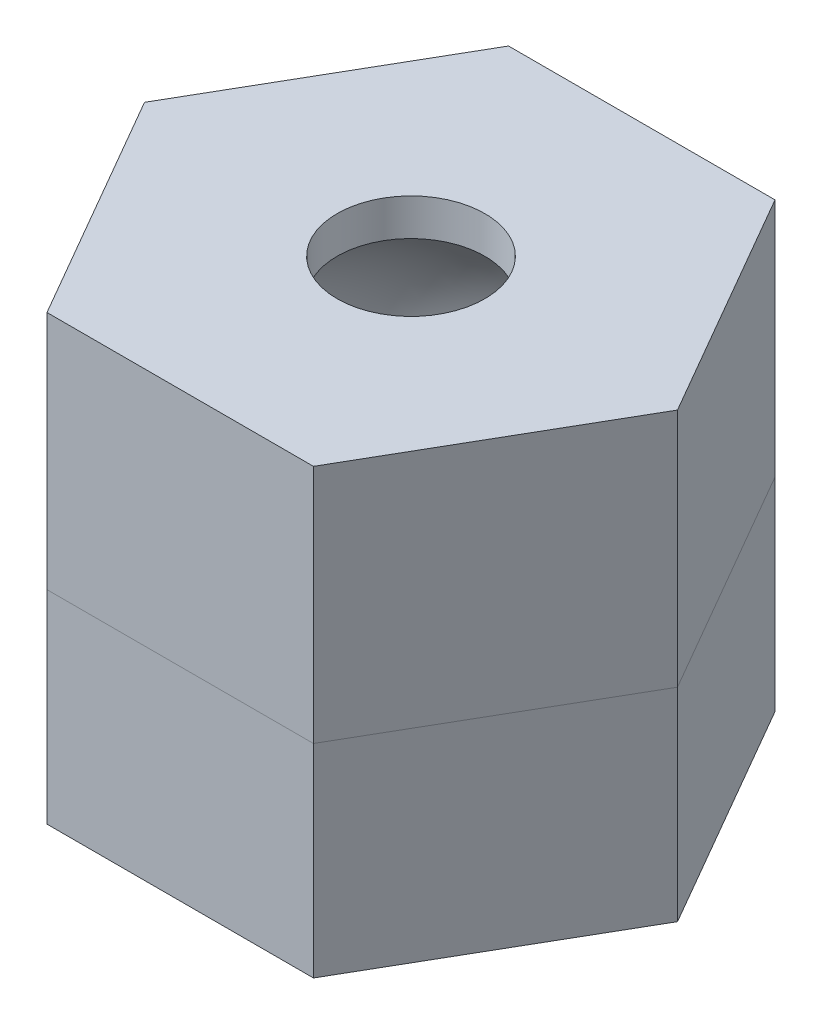
ISO-10303-21;
HEADER;
FILE_DESCRIPTION(('STEP AP214'),'2;1');
FILE_NAME('part.step','',(''),(''),'','','');
FILE_SCHEMA(('AUTOMOTIVE_DESIGN { 1 0 10303 214 1 1 1 1 }'));
ENDSEC;
DATA;
#1=APPLICATION_CONTEXT('core data for automotive mechanical design processes');
#2=APPLICATION_PROTOCOL_DEFINITION('international standard','automotive_design',2000,#1);
#3=PRODUCT_CONTEXT('',#1,'mechanical');
#4=PRODUCT('Part','Part','',(#3));
#5=PRODUCT_RELATED_PRODUCT_CATEGORY('part','',(#4));
#6=PRODUCT_DEFINITION_FORMATION('','',#4);
#7=PRODUCT_DEFINITION_CONTEXT('part definition',#1,'design');
#8=PRODUCT_DEFINITION('design','',#6,#7);
#9=PRODUCT_DEFINITION_SHAPE('','',#8);
#10=(LENGTH_UNIT() NAMED_UNIT(*) SI_UNIT(.MILLI.,.METRE.));
#11=(NAMED_UNIT(*) PLANE_ANGLE_UNIT() SI_UNIT($,.RADIAN.));
#12=(NAMED_UNIT(*) SI_UNIT($,.STERADIAN.) SOLID_ANGLE_UNIT());
#13=UNCERTAINTY_MEASURE_WITH_UNIT(LENGTH_MEASURE(1.E-05),#10,'distance_accuracy_value','');
#14=(GEOMETRIC_REPRESENTATION_CONTEXT(3) GLOBAL_UNCERTAINTY_ASSIGNED_CONTEXT((#13)) GLOBAL_UNIT_ASSIGNED_CONTEXT((#10,
#11,#12)) REPRESENTATION_CONTEXT('',''));
#15=CARTESIAN_POINT('',(0.,0.,0.));
#16=DIRECTION('',(0.,0.,1.));
#17=DIRECTION('',(1.,0.,0.));
#18=AXIS2_PLACEMENT_3D('',#15,#16,#17);
#19=CARTESIAN_POINT('',(0.,55.,0.));
#20=DIRECTION('',(0.,1.,0.));
#21=DIRECTION('',(0.,0.,1.));
#22=AXIS2_PLACEMENT_3D('',#19,#20,#21);
#23=PLANE('',#22);
#24=CARTESIAN_POINT('',(31.25,55.,-54.1265877365274));
#25=DIRECTION('',(0.,1.,0.));
#26=DIRECTION('',(0.,0.,1.));
#27=AXIS2_PLACEMENT_3D('',#24,#25,#26);
#28=CIRCLE('',#27,4.50000000000001);
#29=CARTESIAN_POINT('',(31.25,55.,-49.6265877365274));
#30=VERTEX_POINT('',#29);
#31=EDGE_CURVE('E249',#30,#30,#28,.T.);
#32=ORIENTED_EDGE('',*,*,#31,.F.);
#33=EDGE_LOOP('',(#32));
#34=FACE_BOUND('',#33,.T.);
#35=CARTESIAN_POINT('',(-31.25,55.,-54.1265877365274));
#36=DIRECTION('',(0.,1.,0.));
#37=DIRECTION('',(0.,0.,1.));
#38=AXIS2_PLACEMENT_3D('',#35,#36,#37);
#39=CIRCLE('',#38,4.50000000000001);
#40=CARTESIAN_POINT('',(-31.25,55.,-49.6265877365274));
#41=VERTEX_POINT('',#40);
#42=EDGE_CURVE('E248',#41,#41,#39,.T.);
#43=ORIENTED_EDGE('',*,*,#42,.F.);
#44=EDGE_LOOP('',(#43));
#45=FACE_BOUND('',#44,.T.);
#46=CARTESIAN_POINT('',(-62.5,55.,0.));
#47=DIRECTION('',(0.,1.,0.));
#48=DIRECTION('',(0.,0.,1.));
#49=AXIS2_PLACEMENT_3D('',#46,#47,#48);
#50=CIRCLE('',#49,4.50000000000001);
#51=CARTESIAN_POINT('',(-62.5,55.,4.50000000000002));
#52=VERTEX_POINT('',#51);
#53=EDGE_CURVE('E258',#52,#52,#50,.T.);
#54=ORIENTED_EDGE('',*,*,#53,.F.);
#55=EDGE_LOOP('',(#54));
#56=FACE_BOUND('',#55,.T.);
#57=CARTESIAN_POINT('',(-31.25,55.,54.1265877365274));
#58=DIRECTION('',(0.,1.,0.));
#59=DIRECTION('',(0.,0.,1.));
#60=AXIS2_PLACEMENT_3D('',#57,#58,#59);
#61=CIRCLE('',#60,4.50000000000002);
#62=CARTESIAN_POINT('',(-31.25,55.,58.6265877365274));
#63=VERTEX_POINT('',#62);
#64=EDGE_CURVE('E263',#63,#63,#61,.T.);
#65=ORIENTED_EDGE('',*,*,#64,.F.);
#66=EDGE_LOOP('',(#65));
#67=FACE_BOUND('',#66,.T.);
#68=CARTESIAN_POINT('',(31.25,55.,54.1265877365274));
#69=DIRECTION('',(0.,1.,0.));
#70=DIRECTION('',(0.,0.,1.));
#71=AXIS2_PLACEMENT_3D('',#68,#69,#70);
#72=CIRCLE('',#71,4.50000000000001);
#73=CARTESIAN_POINT('',(31.25,55.,58.6265877365274));
#74=VERTEX_POINT('',#73);
#75=EDGE_CURVE('E269',#74,#74,#72,.T.);
#76=ORIENTED_EDGE('',*,*,#75,.F.);
#77=EDGE_LOOP('',(#76));
#78=FACE_BOUND('',#77,.T.);
#79=CARTESIAN_POINT('',(62.5,55.,0.));
#80=DIRECTION('',(0.,1.,0.));
#81=DIRECTION('',(0.,0.,1.));
#82=AXIS2_PLACEMENT_3D('',#79,#80,#81);
#83=CIRCLE('',#82,4.5);
#84=CARTESIAN_POINT('',(62.5,55.,4.5));
#85=VERTEX_POINT('',#84);
#86=EDGE_CURVE('E132',#85,#85,#83,.T.);
#87=ORIENTED_EDGE('',*,*,#86,.F.);
#88=EDGE_LOOP('',(#87));
#89=FACE_BOUND('',#88,.T.);
#90=DIRECTION('',(1.,0.,0.));
#91=VECTOR('',#90,1.);
#92=CARTESIAN_POINT('',(-36.0843918243516,55.,62.5));
#93=LINE('',#92,#91);
#94=CARTESIAN_POINT('',(-36.0843918243516,55.,62.5));
#95=VERTEX_POINT('',#94);
#96=CARTESIAN_POINT('',(36.0843918243516,55.,62.5));
#97=VERTEX_POINT('',#96);
#98=EDGE_CURVE('E107',#95,#97,#93,.T.);
#99=ORIENTED_EDGE('',*,*,#98,.T.);
#100=DIRECTION('',(0.499999999999999,0.,-0.866025403784439));
#101=VECTOR('',#100,1.);
#102=CARTESIAN_POINT('',(36.0843918243516,55.,62.5));
#103=LINE('',#102,#101);
#104=CARTESIAN_POINT('',(72.1687836487032,55.,0.));
#105=VERTEX_POINT('',#104);
#106=EDGE_CURVE('E115',#97,#105,#103,.T.);
#107=ORIENTED_EDGE('',*,*,#106,.T.);
#108=DIRECTION('',(-0.5,0.,-0.866025403784438));
#109=VECTOR('',#108,1.);
#110=CARTESIAN_POINT('',(72.1687836487032,55.,0.));
#111=LINE('',#110,#109);
#112=CARTESIAN_POINT('',(36.0843918243516,55.,-62.5));
#113=VERTEX_POINT('',#112);
#114=EDGE_CURVE('E120',#105,#113,#111,.T.);
#115=ORIENTED_EDGE('',*,*,#114,.T.);
#116=DIRECTION('',(-1.,0.,0.));
#117=VECTOR('',#116,1.);
#118=CARTESIAN_POINT('',(36.0843918243516,55.,-62.5));
#119=LINE('',#118,#117);
#120=CARTESIAN_POINT('',(-36.0843918243516,55.,-62.5));
#121=VERTEX_POINT('',#120);
#122=EDGE_CURVE('E164',#113,#121,#119,.T.);
#123=ORIENTED_EDGE('',*,*,#122,.T.);
#124=DIRECTION('',(-0.499999999999999,0.,0.866025403784439));
#125=VECTOR('',#124,1.);
#126=CARTESIAN_POINT('',(-36.0843918243516,55.,-62.5));
#127=LINE('',#126,#125);
#128=CARTESIAN_POINT('',(-72.1687836487032,55.,0.));
#129=VERTEX_POINT('',#128);
#130=EDGE_CURVE('E129',#121,#129,#127,.T.);
#131=ORIENTED_EDGE('',*,*,#130,.T.);
#132=DIRECTION('',(0.5,0.,0.866025403784439));
#133=VECTOR('',#132,1.);
#134=CARTESIAN_POINT('',(-72.1687836487032,55.,0.));
#135=LINE('',#134,#133);
#136=EDGE_CURVE('E126',#129,#95,#135,.T.);
#137=ORIENTED_EDGE('',*,*,#136,.T.);
#138=EDGE_LOOP('',(#99,#107,#115,#123,#131,#137));
#139=FACE_BOUND('',#138,.T.);
#140=CARTESIAN_POINT('',(0.,55.,0.));
#141=DIRECTION('',(0.,1.,0.));
#142=DIRECTION('',(0.,0.,1.));
#143=AXIS2_PLACEMENT_3D('',#140,#141,#142);
#144=CIRCLE('',#143,54.8709661048334);
#145=CARTESIAN_POINT('',(0.,55.,54.8709661048334));
#146=VERTEX_POINT('',#145);
#147=EDGE_CURVE('E119',#146,#146,#144,.T.);
#148=ORIENTED_EDGE('',*,*,#147,.F.);
#149=EDGE_LOOP('',(#148));
#150=FACE_BOUND('',#149,.T.);
#151=ADVANCED_FACE('F49',(#34,#45,#56,#67,#78,#89,#139,#150),#23,.T.);
#152=CARTESIAN_POINT('',(0.,7.53049234040404,0.));
#153=DIRECTION('',(0.,1.,0.));
#154=DIRECTION('',(0.,0.,1.));
#155=AXIS2_PLACEMENT_3D('',#152,#153,#154);
#156=PLANE('',#155);
#157=CARTESIAN_POINT('',(0.,7.53049234040402,0.));
#158=DIRECTION('',(0.,1.,0.));
#159=DIRECTION('',(0.,0.,1.));
#160=AXIS2_PLACEMENT_3D('',#157,#158,#159);
#161=CIRCLE('',#160,20.);
#162=CARTESIAN_POINT('',(0.,7.53049234040402,20.));
#163=VERTEX_POINT('',#162);
#164=EDGE_CURVE('E13',#163,#163,#161,.T.);
#165=ORIENTED_EDGE('',*,*,#164,.T.);
#166=EDGE_LOOP('',(#165));
#167=FACE_BOUND('',#166,.T.);
#168=ADVANCED_FACE('F180',(#167),#156,.T.);
#169=CARTESIAN_POINT('',(0.,58.765246170202,0.));
#170=DIRECTION('',(0.,1.,0.));
#171=DIRECTION('',(0.,0.,-1.));
#172=AXIS2_PLACEMENT_3D('',#169,#170,#171);
#173=SPHERICAL_SURFACE('',#172,55.);
#174=ORIENTED_EDGE('',*,*,#164,.F.);
#175=EDGE_LOOP('',(#174));
#176=FACE_BOUND('',#175,.T.);
#177=ORIENTED_EDGE('',*,*,#147,.T.);
#178=EDGE_LOOP('',(#177));
#179=FACE_BOUND('',#178,.T.);
#180=ADVANCED_FACE('F182',(#176,#179),#173,.F.);
#181=CARTESIAN_POINT('',(36.0843918243516,110.,62.5));
#182=DIRECTION('',(-0.866025403784439,0.,-0.499999999999999));
#183=DIRECTION('',(-0.499999999999999,0.,0.866025403784439));
#184=AXIS2_PLACEMENT_3D('',#181,#182,#183);
#185=PLANE('',#184);
#186=ORIENTED_EDGE('',*,*,#106,.F.);
#187=DIRECTION('',(0.,-1.,0.));
#188=VECTOR('',#187,1.);
#189=CARTESIAN_POINT('',(36.0843918243516,110.,62.5));
#190=LINE('',#189,#188);
#191=CARTESIAN_POINT('',(36.0843918243516,0.,62.5));
#192=VERTEX_POINT('',#191);
#193=EDGE_CURVE('E53',#97,#192,#190,.T.);
#194=ORIENTED_EDGE('',*,*,#193,.T.);
#195=DIRECTION('',(0.499999999999999,0.,-0.866025403784439));
#196=VECTOR('',#195,1.);
#197=CARTESIAN_POINT('',(36.0843918243516,0.,62.5));
#198=LINE('',#197,#196);
#199=CARTESIAN_POINT('',(72.1687836487032,0.,0.));
#200=VERTEX_POINT('',#199);
#201=EDGE_CURVE('E58',#192,#200,#198,.T.);
#202=ORIENTED_EDGE('',*,*,#201,.T.);
#203=DIRECTION('',(0.,-1.,0.));
#204=VECTOR('',#203,1.);
#205=CARTESIAN_POINT('',(72.1687836487032,110.,0.));
#206=LINE('',#205,#204);
#207=EDGE_CURVE('E66',#105,#200,#206,.T.);
#208=ORIENTED_EDGE('',*,*,#207,.F.);
#209=EDGE_LOOP('',(#186,#194,#202,#208));
#210=FACE_BOUND('',#209,.T.);
#211=ADVANCED_FACE('F116',(#210),#185,.F.);
#212=CARTESIAN_POINT('',(72.1687836487032,110.,0.));
#213=DIRECTION('',(-0.866025403784438,0.,0.5));
#214=DIRECTION('',(0.5,0.,0.866025403784438));
#215=AXIS2_PLACEMENT_3D('',#212,#213,#214);
#216=PLANE('',#215);
#217=ORIENTED_EDGE('',*,*,#114,.F.);
#218=ORIENTED_EDGE('',*,*,#207,.T.);
#219=DIRECTION('',(-0.5,0.,-0.866025403784438));
#220=VECTOR('',#219,1.);
#221=CARTESIAN_POINT('',(72.1687836487032,0.,0.));
#222=LINE('',#221,#220);
#223=CARTESIAN_POINT('',(36.0843918243516,0.,-62.5));
#224=VERTEX_POINT('',#223);
#225=EDGE_CURVE('E158',#200,#224,#222,.T.);
#226=ORIENTED_EDGE('',*,*,#225,.T.);
#227=DIRECTION('',(0.,-1.,0.));
#228=VECTOR('',#227,1.);
#229=CARTESIAN_POINT('',(36.0843918243516,110.,-62.5));
#230=LINE('',#229,#228);
#231=EDGE_CURVE('E74',#113,#224,#230,.T.);
#232=ORIENTED_EDGE('',*,*,#231,.F.);
#233=EDGE_LOOP('',(#217,#218,#226,#232));
#234=FACE_BOUND('',#233,.T.);
#235=ADVANCED_FACE('F172',(#234),#216,.F.);
#236=CARTESIAN_POINT('',(36.0843918243516,110.,-62.5));
#237=DIRECTION('',(0.,0.,1.));
#238=DIRECTION('',(1.,0.,0.));
#239=AXIS2_PLACEMENT_3D('',#236,#237,#238);
#240=PLANE('',#239);
#241=ORIENTED_EDGE('',*,*,#122,.F.);
#242=ORIENTED_EDGE('',*,*,#231,.T.);
#243=DIRECTION('',(-1.,0.,0.));
#244=VECTOR('',#243,1.);
#245=CARTESIAN_POINT('',(36.0843918243516,0.,-62.5));
#246=LINE('',#245,#244);
#247=CARTESIAN_POINT('',(-36.0843918243516,0.,-62.5));
#248=VERTEX_POINT('',#247);
#249=EDGE_CURVE('E156',#224,#248,#246,.T.);
#250=ORIENTED_EDGE('',*,*,#249,.T.);
#251=DIRECTION('',(0.,-1.,0.));
#252=VECTOR('',#251,1.);
#253=CARTESIAN_POINT('',(-36.0843918243516,110.,-62.5));
#254=LINE('',#253,#252);
#255=EDGE_CURVE('E138',#121,#248,#254,.T.);
#256=ORIENTED_EDGE('',*,*,#255,.F.);
#257=EDGE_LOOP('',(#241,#242,#250,#256));
#258=FACE_BOUND('',#257,.T.);
#259=ADVANCED_FACE('F170',(#258),#240,.F.);
#260=CARTESIAN_POINT('',(-36.0843918243516,110.,-62.5));
#261=DIRECTION('',(0.866025403784439,0.,0.499999999999999));
#262=DIRECTION('',(0.499999999999999,0.,-0.866025403784439));
#263=AXIS2_PLACEMENT_3D('',#260,#261,#262);
#264=PLANE('',#263);
#265=ORIENTED_EDGE('',*,*,#130,.F.);
#266=ORIENTED_EDGE('',*,*,#255,.T.);
#267=DIRECTION('',(-0.499999999999999,0.,0.866025403784439));
#268=VECTOR('',#267,1.);
#269=CARTESIAN_POINT('',(-36.0843918243516,0.,-62.5));
#270=LINE('',#269,#268);
#271=CARTESIAN_POINT('',(-72.1687836487032,0.,0.));
#272=VERTEX_POINT('',#271);
#273=EDGE_CURVE('E149',#248,#272,#270,.T.);
#274=ORIENTED_EDGE('',*,*,#273,.T.);
#275=DIRECTION('',(0.,-1.,0.));
#276=VECTOR('',#275,1.);
#277=CARTESIAN_POINT('',(-72.1687836487032,110.,0.));
#278=LINE('',#277,#276);
#279=EDGE_CURVE('E140',#129,#272,#278,.T.);
#280=ORIENTED_EDGE('',*,*,#279,.F.);
#281=EDGE_LOOP('',(#265,#266,#274,#280));
#282=FACE_BOUND('',#281,.T.);
#283=ADVANCED_FACE('F168',(#282),#264,.F.);
#284=CARTESIAN_POINT('',(-72.1687836487032,110.,0.));
#285=DIRECTION('',(0.866025403784439,0.,-0.5));
#286=DIRECTION('',(-0.5,0.,-0.866025403784439));
#287=AXIS2_PLACEMENT_3D('',#284,#285,#286);
#288=PLANE('',#287);
#289=ORIENTED_EDGE('',*,*,#136,.F.);
#290=ORIENTED_EDGE('',*,*,#279,.T.);
#291=DIRECTION('',(0.5,0.,0.866025403784438));
#292=VECTOR('',#291,1.);
#293=CARTESIAN_POINT('',(-72.1687836487032,0.,0.));
#294=LINE('',#293,#292);
#295=CARTESIAN_POINT('',(-36.0843918243516,0.,62.5));
#296=VERTEX_POINT('',#295);
#297=EDGE_CURVE('E144',#272,#296,#294,.T.);
#298=ORIENTED_EDGE('',*,*,#297,.T.);
#299=DIRECTION('',(0.,-1.,0.));
#300=VECTOR('',#299,1.);
#301=CARTESIAN_POINT('',(-36.0843918243516,110.,62.5));
#302=LINE('',#301,#300);
#303=EDGE_CURVE('E113',#95,#296,#302,.T.);
#304=ORIENTED_EDGE('',*,*,#303,.F.);
#305=EDGE_LOOP('',(#289,#290,#298,#304));
#306=FACE_BOUND('',#305,.T.);
#307=ADVANCED_FACE('F145',(#306),#288,.F.);
#308=CARTESIAN_POINT('',(-36.0843918243516,110.,62.5));
#309=DIRECTION('',(0.,0.,-1.));
#310=DIRECTION('',(-1.,0.,0.));
#311=AXIS2_PLACEMENT_3D('',#308,#309,#310);
#312=PLANE('',#311);
#313=ORIENTED_EDGE('',*,*,#98,.F.);
#314=ORIENTED_EDGE('',*,*,#303,.T.);
#315=DIRECTION('',(1.,0.,0.));
#316=VECTOR('',#315,1.);
#317=CARTESIAN_POINT('',(-36.0843918243516,0.,62.5));
#318=LINE('',#317,#316);
#319=EDGE_CURVE('E109',#296,#192,#318,.T.);
#320=ORIENTED_EDGE('',*,*,#319,.T.);
#321=ORIENTED_EDGE('',*,*,#193,.F.);
#322=EDGE_LOOP('',(#313,#314,#320,#321));
#323=FACE_BOUND('',#322,.T.);
#324=ADVANCED_FACE('F51',(#323),#312,.F.);
#325=CARTESIAN_POINT('',(0.,0.,0.));
#326=DIRECTION('',(0.,1.,0.));
#327=DIRECTION('',(0.,0.,1.));
#328=AXIS2_PLACEMENT_3D('',#325,#326,#327);
#329=PLANE('',#328);
#330=ORIENTED_EDGE('',*,*,#201,.F.);
#331=ORIENTED_EDGE('',*,*,#319,.F.);
#332=ORIENTED_EDGE('',*,*,#297,.F.);
#333=ORIENTED_EDGE('',*,*,#273,.F.);
#334=ORIENTED_EDGE('',*,*,#249,.F.);
#335=ORIENTED_EDGE('',*,*,#225,.F.);
#336=EDGE_LOOP('',(#330,#331,#332,#333,#334,#335));
#337=FACE_BOUND('',#336,.T.);
#338=ADVANCED_FACE('F151',(#337),#329,.F.);
#339=CARTESIAN_POINT('',(62.5,65.,0.));
#340=DIRECTION('',(0.,-1.,0.));
#341=DIRECTION('',(0.,0.,-1.));
#342=AXIS2_PLACEMENT_3D('',#339,#340,#341);
#343=CYLINDRICAL_SURFACE('',#342,4.5);
#344=CARTESIAN_POINT('',(62.5,65.,0.));
#345=DIRECTION('',(0.,1.,0.));
#346=DIRECTION('',(0.,0.,1.));
#347=AXIS2_PLACEMENT_3D('',#344,#345,#346);
#348=CIRCLE('',#347,4.5);
#349=CARTESIAN_POINT('',(62.5,65.,4.5));
#350=VERTEX_POINT('',#349);
#351=EDGE_CURVE('E127',#350,#350,#348,.T.);
#352=ORIENTED_EDGE('',*,*,#351,.F.);
#353=EDGE_LOOP('',(#352));
#354=FACE_BOUND('',#353,.T.);
#355=ORIENTED_EDGE('',*,*,#86,.T.);
#356=EDGE_LOOP('',(#355));
#357=FACE_BOUND('',#356,.T.);
#358=ADVANCED_FACE('F193',(#354,#357),#343,.T.);
#359=CARTESIAN_POINT('',(62.5,65.,0.));
#360=DIRECTION('',(0.,1.,0.));
#361=DIRECTION('',(0.,0.,1.));
#362=AXIS2_PLACEMENT_3D('',#359,#360,#361);
#363=PLANE('',#362);
#364=ORIENTED_EDGE('',*,*,#351,.T.);
#365=EDGE_LOOP('',(#364));
#366=FACE_BOUND('',#365,.T.);
#367=ADVANCED_FACE('F199',(#366),#363,.T.);
#368=CARTESIAN_POINT('',(31.25,65.,54.1265877365274));
#369=DIRECTION('',(0.,-1.,0.));
#370=DIRECTION('',(0.,0.,-1.));
#371=AXIS2_PLACEMENT_3D('',#368,#369,#370);
#372=CYLINDRICAL_SURFACE('',#371,4.50000000000001);
#373=CARTESIAN_POINT('',(31.25,65.,54.1265877365274));
#374=DIRECTION('',(0.,1.,0.));
#375=DIRECTION('',(0.,0.,1.));
#376=AXIS2_PLACEMENT_3D('',#373,#374,#375);
#377=CIRCLE('',#376,4.50000000000001);
#378=CARTESIAN_POINT('',(31.25,65.,58.6265877365274));
#379=VERTEX_POINT('',#378);
#380=EDGE_CURVE('E272',#379,#379,#377,.T.);
#381=ORIENTED_EDGE('',*,*,#380,.F.);
#382=EDGE_LOOP('',(#381));
#383=FACE_BOUND('',#382,.T.);
#384=ORIENTED_EDGE('',*,*,#75,.T.);
#385=EDGE_LOOP('',(#384));
#386=FACE_BOUND('',#385,.T.);
#387=ADVANCED_FACE('F203',(#383,#386),#372,.T.);
#388=CARTESIAN_POINT('',(31.25,65.,54.1265877365274));
#389=DIRECTION('',(0.,1.,0.));
#390=DIRECTION('',(0.,0.,1.));
#391=AXIS2_PLACEMENT_3D('',#388,#389,#390);
#392=PLANE('',#391);
#393=ORIENTED_EDGE('',*,*,#380,.T.);
#394=EDGE_LOOP('',(#393));
#395=FACE_BOUND('',#394,.T.);
#396=ADVANCED_FACE('F207',(#395),#392,.T.);
#397=CARTESIAN_POINT('',(-31.25,65.,54.1265877365274));
#398=DIRECTION('',(0.,-1.,0.));
#399=DIRECTION('',(0.,0.,-1.));
#400=AXIS2_PLACEMENT_3D('',#397,#398,#399);
#401=CYLINDRICAL_SURFACE('',#400,4.50000000000002);
#402=CARTESIAN_POINT('',(-31.25,65.,54.1265877365274));
#403=DIRECTION('',(0.,1.,0.));
#404=DIRECTION('',(0.,0.,1.));
#405=AXIS2_PLACEMENT_3D('',#402,#403,#404);
#406=CIRCLE('',#405,4.50000000000002);
#407=CARTESIAN_POINT('',(-31.25,65.,58.6265877365274));
#408=VERTEX_POINT('',#407);
#409=EDGE_CURVE('E266',#408,#408,#406,.T.);
#410=ORIENTED_EDGE('',*,*,#409,.F.);
#411=EDGE_LOOP('',(#410));
#412=FACE_BOUND('',#411,.T.);
#413=ORIENTED_EDGE('',*,*,#64,.T.);
#414=EDGE_LOOP('',(#413));
#415=FACE_BOUND('',#414,.T.);
#416=ADVANCED_FACE('F211',(#412,#415),#401,.T.);
#417=CARTESIAN_POINT('',(-31.25,65.,54.1265877365274));
#418=DIRECTION('',(0.,1.,0.));
#419=DIRECTION('',(0.,0.,1.));
#420=AXIS2_PLACEMENT_3D('',#417,#418,#419);
#421=PLANE('',#420);
#422=ORIENTED_EDGE('',*,*,#409,.T.);
#423=EDGE_LOOP('',(#422));
#424=FACE_BOUND('',#423,.T.);
#425=ADVANCED_FACE('F215',(#424),#421,.T.);
#426=CARTESIAN_POINT('',(-62.5,65.,0.));
#427=DIRECTION('',(0.,-1.,0.));
#428=DIRECTION('',(0.,0.,-1.));
#429=AXIS2_PLACEMENT_3D('',#426,#427,#428);
#430=CYLINDRICAL_SURFACE('',#429,4.50000000000001);
#431=CARTESIAN_POINT('',(-62.5,65.,0.));
#432=DIRECTION('',(0.,1.,0.));
#433=DIRECTION('',(0.,0.,1.));
#434=AXIS2_PLACEMENT_3D('',#431,#432,#433);
#435=CIRCLE('',#434,4.50000000000001);
#436=CARTESIAN_POINT('',(-62.5,65.,4.50000000000002));
#437=VERTEX_POINT('',#436);
#438=EDGE_CURVE('E260',#437,#437,#435,.T.);
#439=ORIENTED_EDGE('',*,*,#438,.F.);
#440=EDGE_LOOP('',(#439));
#441=FACE_BOUND('',#440,.T.);
#442=ORIENTED_EDGE('',*,*,#53,.T.);
#443=EDGE_LOOP('',(#442));
#444=FACE_BOUND('',#443,.T.);
#445=ADVANCED_FACE('F219',(#441,#444),#430,.T.);
#446=CARTESIAN_POINT('',(-62.5,65.,0.));
#447=DIRECTION('',(0.,1.,0.));
#448=DIRECTION('',(0.,0.,1.));
#449=AXIS2_PLACEMENT_3D('',#446,#447,#448);
#450=PLANE('',#449);
#451=ORIENTED_EDGE('',*,*,#438,.T.);
#452=EDGE_LOOP('',(#451));
#453=FACE_BOUND('',#452,.T.);
#454=ADVANCED_FACE('F223',(#453),#450,.T.);
#455=CARTESIAN_POINT('',(-31.25,65.,-54.1265877365274));
#456=DIRECTION('',(0.,-1.,0.));
#457=DIRECTION('',(0.,0.,-1.));
#458=AXIS2_PLACEMENT_3D('',#455,#456,#457);
#459=CYLINDRICAL_SURFACE('',#458,4.50000000000001);
#460=CARTESIAN_POINT('',(-31.25,65.,-54.1265877365274));
#461=DIRECTION('',(0.,1.,0.));
#462=DIRECTION('',(0.,0.,1.));
#463=AXIS2_PLACEMENT_3D('',#460,#461,#462);
#464=CIRCLE('',#463,4.50000000000001);
#465=CARTESIAN_POINT('',(-31.25,65.,-49.6265877365274));
#466=VERTEX_POINT('',#465);
#467=EDGE_CURVE('E252',#466,#466,#464,.T.);
#468=ORIENTED_EDGE('',*,*,#467,.F.);
#469=EDGE_LOOP('',(#468));
#470=FACE_BOUND('',#469,.T.);
#471=ORIENTED_EDGE('',*,*,#42,.T.);
#472=EDGE_LOOP('',(#471));
#473=FACE_BOUND('',#472,.T.);
#474=ADVANCED_FACE('F227',(#470,#473),#459,.T.);
#475=CARTESIAN_POINT('',(-31.25,65.,-54.1265877365274));
#476=DIRECTION('',(0.,1.,0.));
#477=DIRECTION('',(0.,0.,1.));
#478=AXIS2_PLACEMENT_3D('',#475,#476,#477);
#479=PLANE('',#478);
#480=ORIENTED_EDGE('',*,*,#467,.T.);
#481=EDGE_LOOP('',(#480));
#482=FACE_BOUND('',#481,.T.);
#483=ADVANCED_FACE('F231',(#482),#479,.T.);
#484=CARTESIAN_POINT('',(31.25,65.,-54.1265877365274));
#485=DIRECTION('',(0.,-1.,0.));
#486=DIRECTION('',(0.,0.,-1.));
#487=AXIS2_PLACEMENT_3D('',#484,#485,#486);
#488=CYLINDRICAL_SURFACE('',#487,4.50000000000001);
#489=CARTESIAN_POINT('',(31.25,65.,-54.1265877365274));
#490=DIRECTION('',(0.,1.,0.));
#491=DIRECTION('',(0.,0.,1.));
#492=AXIS2_PLACEMENT_3D('',#489,#490,#491);
#493=CIRCLE('',#492,4.50000000000001);
#494=CARTESIAN_POINT('',(31.25,65.,-49.6265877365274));
#495=VERTEX_POINT('',#494);
#496=EDGE_CURVE('E247',#495,#495,#493,.T.);
#497=ORIENTED_EDGE('',*,*,#496,.F.);
#498=EDGE_LOOP('',(#497));
#499=FACE_BOUND('',#498,.T.);
#500=ORIENTED_EDGE('',*,*,#31,.T.);
#501=EDGE_LOOP('',(#500));
#502=FACE_BOUND('',#501,.T.);
#503=ADVANCED_FACE('F235',(#499,#502),#488,.T.);
#504=CARTESIAN_POINT('',(31.25,65.,-54.1265877365274));
#505=DIRECTION('',(0.,1.,0.));
#506=DIRECTION('',(0.,0.,1.));
#507=AXIS2_PLACEMENT_3D('',#504,#505,#506);
#508=PLANE('',#507);
#509=ORIENTED_EDGE('',*,*,#496,.T.);
#510=EDGE_LOOP('',(#509));
#511=FACE_BOUND('',#510,.T.);
#512=ADVANCED_FACE('F239',(#511),#508,.T.);
#513=CLOSED_SHELL('',(#151,#168,#180,#211,#235,#259,#283,#307,#324,#338,#358,#367,#387,#396,
#416,#425,#445,#454,#474,#483,#503,#512));
#514=MANIFOLD_SOLID_BREP('B2',#513);
#515=CARTESIAN_POINT('',(0.,55.,0.));
#516=DIRECTION('',(0.,1.,0.));
#517=DIRECTION('',(0.,0.,1.));
#518=AXIS2_PLACEMENT_3D('',#515,#516,#517);
#519=PLANE('',#518);
#520=CARTESIAN_POINT('',(62.5,55.,0.));
#521=DIRECTION('',(0.,1.,0.));
#522=DIRECTION('',(0.,0.,1.));
#523=AXIS2_PLACEMENT_3D('',#520,#521,#522);
#524=CIRCLE('',#523,5.);
#525=CARTESIAN_POINT('',(62.5,55.,5.));
#526=VERTEX_POINT('',#525);
#527=EDGE_CURVE('E529',#526,#526,#524,.T.);
#528=ORIENTED_EDGE('',*,*,#527,.T.);
#529=EDGE_LOOP('',(#528));
#530=FACE_BOUND('',#529,.T.);
#531=CARTESIAN_POINT('',(31.25,55.,-54.1265877365274));
#532=DIRECTION('',(0.,1.,0.));
#533=DIRECTION('',(0.,0.,1.));
#534=AXIS2_PLACEMENT_3D('',#531,#532,#533);
#535=CIRCLE('',#534,5.00000000000001);
#536=CARTESIAN_POINT('',(31.25,55.,-49.1265877365274));
#537=VERTEX_POINT('',#536);
#538=EDGE_CURVE('E526',#537,#537,#535,.T.);
#539=ORIENTED_EDGE('',*,*,#538,.T.);
#540=EDGE_LOOP('',(#539));
#541=FACE_BOUND('',#540,.T.);
#542=CARTESIAN_POINT('',(-31.25,55.,-54.1265877365274));
#543=DIRECTION('',(0.,1.,0.));
#544=DIRECTION('',(0.,0.,1.));
#545=AXIS2_PLACEMENT_3D('',#542,#543,#544);
#546=CIRCLE('',#545,5.);
#547=CARTESIAN_POINT('',(-31.25,55.,-49.1265877365274));
#548=VERTEX_POINT('',#547);
#549=EDGE_CURVE('E536',#548,#548,#546,.T.);
#550=ORIENTED_EDGE('',*,*,#549,.T.);
#551=EDGE_LOOP('',(#550));
#552=FACE_BOUND('',#551,.T.);
#553=CARTESIAN_POINT('',(-62.5,55.,0.));
#554=DIRECTION('',(0.,1.,0.));
#555=DIRECTION('',(0.,0.,1.));
#556=AXIS2_PLACEMENT_3D('',#553,#554,#555);
#557=CIRCLE('',#556,5.);
#558=CARTESIAN_POINT('',(-62.5,55.,5.00000000000001));
#559=VERTEX_POINT('',#558);
#560=EDGE_CURVE('E553',#559,#559,#557,.T.);
#561=ORIENTED_EDGE('',*,*,#560,.T.);
#562=EDGE_LOOP('',(#561));
#563=FACE_BOUND('',#562,.T.);
#564=CARTESIAN_POINT('',(-31.25,55.,54.1265877365274));
#565=DIRECTION('',(0.,1.,0.));
#566=DIRECTION('',(0.,0.,1.));
#567=AXIS2_PLACEMENT_3D('',#564,#565,#566);
#568=CIRCLE('',#567,5.00000000000001);
#569=CARTESIAN_POINT('',(-31.25,55.,59.1265877365274));
#570=VERTEX_POINT('',#569);
#571=EDGE_CURVE('E547',#570,#570,#568,.T.);
#572=ORIENTED_EDGE('',*,*,#571,.T.);
#573=EDGE_LOOP('',(#572));
#574=FACE_BOUND('',#573,.T.);
#575=CARTESIAN_POINT('',(31.25,55.,54.1265877365274));
#576=DIRECTION('',(0.,1.,0.));
#577=DIRECTION('',(0.,0.,1.));
#578=AXIS2_PLACEMENT_3D('',#575,#576,#577);
#579=CIRCLE('',#578,5.00000000000001);
#580=CARTESIAN_POINT('',(31.25,55.,59.1265877365274));
#581=VERTEX_POINT('',#580);
#582=EDGE_CURVE('E541',#581,#581,#579,.T.);
#583=ORIENTED_EDGE('',*,*,#582,.T.);
#584=EDGE_LOOP('',(#583));
#585=FACE_BOUND('',#584,.T.);
#586=CARTESIAN_POINT('',(0.,55.,0.));
#587=DIRECTION('',(0.,1.,0.));
#588=DIRECTION('',(0.,0.,1.));
#589=AXIS2_PLACEMENT_3D('',#586,#587,#588);
#590=CIRCLE('',#589,54.8709661048334);
#591=CARTESIAN_POINT('',(0.,55.,54.8709661048334));
#592=VERTEX_POINT('',#591);
#593=EDGE_CURVE('E47',#592,#592,#590,.T.);
#594=ORIENTED_EDGE('',*,*,#593,.T.);
#595=EDGE_LOOP('',(#594));
#596=FACE_BOUND('',#595,.T.);
#597=DIRECTION('',(1.,0.,0.));
#598=VECTOR('',#597,1.);
#599=CARTESIAN_POINT('',(-36.0843918243516,55.,62.5));
#600=LINE('',#599,#598);
#601=CARTESIAN_POINT('',(-36.0843918243516,55.,62.5));
#602=VERTEX_POINT('',#601);
#603=CARTESIAN_POINT('',(36.0843918243516,55.,62.5));
#604=VERTEX_POINT('',#603);
#605=EDGE_CURVE('E493',#602,#604,#600,.T.);
#606=ORIENTED_EDGE('',*,*,#605,.F.);
#607=DIRECTION('',(0.5,0.,0.866025403784439));
#608=VECTOR('',#607,1.);
#609=CARTESIAN_POINT('',(-72.1687836487032,55.,0.));
#610=LINE('',#609,#608);
#611=CARTESIAN_POINT('',(-72.1687836487032,55.,0.));
#612=VERTEX_POINT('',#611);
#613=EDGE_CURVE('E573',#612,#602,#610,.T.);
#614=ORIENTED_EDGE('',*,*,#613,.F.);
#615=DIRECTION('',(-0.499999999999999,0.,0.866025403784439));
#616=VECTOR('',#615,1.);
#617=CARTESIAN_POINT('',(-36.0843918243516,55.,-62.5));
#618=LINE('',#617,#616);
#619=CARTESIAN_POINT('',(-36.0843918243516,55.,-62.5));
#620=VERTEX_POINT('',#619);
#621=EDGE_CURVE('E575',#620,#612,#618,.T.);
#622=ORIENTED_EDGE('',*,*,#621,.F.);
#623=DIRECTION('',(-1.,0.,0.));
#624=VECTOR('',#623,1.);
#625=CARTESIAN_POINT('',(36.0843918243516,55.,-62.5));
#626=LINE('',#625,#624);
#627=CARTESIAN_POINT('',(36.0843918243516,55.,-62.5));
#628=VERTEX_POINT('',#627);
#629=EDGE_CURVE('E577',#628,#620,#626,.T.);
#630=ORIENTED_EDGE('',*,*,#629,.F.);
#631=DIRECTION('',(-0.5,0.,-0.866025403784438));
#632=VECTOR('',#631,1.);
#633=CARTESIAN_POINT('',(72.1687836487032,55.,0.));
#634=LINE('',#633,#632);
#635=CARTESIAN_POINT('',(72.1687836487032,55.,0.));
#636=VERTEX_POINT('',#635);
#637=EDGE_CURVE('E455',#636,#628,#634,.T.);
#638=ORIENTED_EDGE('',*,*,#637,.F.);
#639=DIRECTION('',(0.499999999999999,0.,-0.866025403784439));
#640=VECTOR('',#639,1.);
#641=CARTESIAN_POINT('',(36.0843918243516,55.,62.5));
#642=LINE('',#641,#640);
#643=EDGE_CURVE('E437',#604,#636,#642,.T.);
#644=ORIENTED_EDGE('',*,*,#643,.F.);
#645=EDGE_LOOP('',(#606,#614,#622,#630,#638,#644));
#646=FACE_BOUND('',#645,.T.);
#647=ADVANCED_FACE('F434',(#530,#541,#552,#563,#574,#585,#596,#646),#519,.F.);
#648=CARTESIAN_POINT('',(72.1687836487032,110.,0.));
#649=DIRECTION('',(-0.866025403784438,0.,0.5));
#650=DIRECTION('',(0.5,0.,0.866025403784438));
#651=AXIS2_PLACEMENT_3D('',#648,#649,#650);
#652=PLANE('',#651);
#653=DIRECTION('',(0.,-1.,0.));
#654=VECTOR('',#653,1.);
#655=CARTESIAN_POINT('',(72.1687836487032,110.,0.));
#656=LINE('',#655,#654);
#657=CARTESIAN_POINT('',(72.1687836487032,120.,0.));
#658=VERTEX_POINT('',#657);
#659=EDGE_CURVE('E500',#658,#636,#656,.T.);
#660=ORIENTED_EDGE('',*,*,#659,.T.);
#661=ORIENTED_EDGE('',*,*,#637,.T.);
#662=DIRECTION('',(0.,-1.,0.));
#663=VECTOR('',#662,1.);
#664=CARTESIAN_POINT('',(36.0843918243516,110.,-62.5));
#665=LINE('',#664,#663);
#666=CARTESIAN_POINT('',(36.0843918243516,120.,-62.5));
#667=VERTEX_POINT('',#666);
#668=EDGE_CURVE('E568',#667,#628,#665,.T.);
#669=ORIENTED_EDGE('',*,*,#668,.F.);
#670=DIRECTION('',(-0.5,0.,-0.866025403784438));
#671=VECTOR('',#670,1.);
#672=CARTESIAN_POINT('',(72.1687836487032,120.,0.));
#673=LINE('',#672,#671);
#674=EDGE_CURVE('E504',#658,#667,#673,.T.);
#675=ORIENTED_EDGE('',*,*,#674,.F.);
#676=EDGE_LOOP('',(#660,#661,#669,#675));
#677=FACE_BOUND('',#676,.T.);
#678=ADVANCED_FACE('F589',(#677),#652,.F.);
#679=CARTESIAN_POINT('',(36.0843918243516,110.,-62.5));
#680=DIRECTION('',(0.,0.,1.));
#681=DIRECTION('',(1.,0.,0.));
#682=AXIS2_PLACEMENT_3D('',#679,#680,#681);
#683=PLANE('',#682);
#684=ORIENTED_EDGE('',*,*,#668,.T.);
#685=ORIENTED_EDGE('',*,*,#629,.T.);
#686=DIRECTION('',(0.,-1.,0.));
#687=VECTOR('',#686,1.);
#688=CARTESIAN_POINT('',(-36.0843918243516,110.,-62.5));
#689=LINE('',#688,#687);
#690=CARTESIAN_POINT('',(-36.0843918243516,120.,-62.5));
#691=VERTEX_POINT('',#690);
#692=EDGE_CURVE('E565',#691,#620,#689,.T.);
#693=ORIENTED_EDGE('',*,*,#692,.F.);
#694=DIRECTION('',(-1.,0.,0.));
#695=VECTOR('',#694,1.);
#696=CARTESIAN_POINT('',(36.0843918243516,120.,-62.5));
#697=LINE('',#696,#695);
#698=EDGE_CURVE('E520',#667,#691,#697,.T.);
#699=ORIENTED_EDGE('',*,*,#698,.F.);
#700=EDGE_LOOP('',(#684,#685,#693,#699));
#701=FACE_BOUND('',#700,.T.);
#702=ADVANCED_FACE('F580',(#701),#683,.F.);
#703=CARTESIAN_POINT('',(-36.0843918243516,110.,-62.5));
#704=DIRECTION('',(0.866025403784439,0.,0.499999999999999));
#705=DIRECTION('',(0.499999999999999,0.,-0.866025403784439));
#706=AXIS2_PLACEMENT_3D('',#703,#704,#705);
#707=PLANE('',#706);
#708=ORIENTED_EDGE('',*,*,#692,.T.);
#709=ORIENTED_EDGE('',*,*,#621,.T.);
#710=DIRECTION('',(0.,-1.,0.));
#711=VECTOR('',#710,1.);
#712=CARTESIAN_POINT('',(-72.1687836487032,110.,0.));
#713=LINE('',#712,#711);
#714=CARTESIAN_POINT('',(-72.1687836487032,120.,0.));
#715=VERTEX_POINT('',#714);
#716=EDGE_CURVE('E562',#715,#612,#713,.T.);
#717=ORIENTED_EDGE('',*,*,#716,.F.);
#718=DIRECTION('',(-0.499999999999999,0.,0.866025403784439));
#719=VECTOR('',#718,1.);
#720=CARTESIAN_POINT('',(-36.0843918243516,120.,-62.5));
#721=LINE('',#720,#719);
#722=EDGE_CURVE('E523',#691,#715,#721,.T.);
#723=ORIENTED_EDGE('',*,*,#722,.F.);
#724=EDGE_LOOP('',(#708,#709,#717,#723));
#725=FACE_BOUND('',#724,.T.);
#726=ADVANCED_FACE('F586',(#725),#707,.F.);
#727=CARTESIAN_POINT('',(0.,58.765246170202,0.));
#728=DIRECTION('',(0.,1.,0.));
#729=DIRECTION('',(0.,0.,-1.));
#730=AXIS2_PLACEMENT_3D('',#727,#728,#729);
#731=SPHERICAL_SURFACE('',#730,55.);
#732=ORIENTED_EDGE('',*,*,#593,.F.);
#733=EDGE_LOOP('',(#732));
#734=FACE_BOUND('',#733,.T.);
#735=CARTESIAN_POINT('',(0.,110.,0.));
#736=DIRECTION('',(0.,1.,0.));
#737=DIRECTION('',(0.,0.,1.));
#738=AXIS2_PLACEMENT_3D('',#735,#736,#737);
#739=CIRCLE('',#738,20.);
#740=CARTESIAN_POINT('',(0.,110.,19.9999999999999));
#741=VERTEX_POINT('',#740);
#742=EDGE_CURVE('E515',#741,#741,#739,.T.);
#743=ORIENTED_EDGE('',*,*,#742,.T.);
#744=EDGE_LOOP('',(#743));
#745=FACE_BOUND('',#744,.T.);
#746=ADVANCED_FACE('F638',(#734,#745),#731,.F.);
#747=CARTESIAN_POINT('',(36.0843918243516,110.,62.5));
#748=DIRECTION('',(-0.866025403784439,0.,-0.499999999999999));
#749=DIRECTION('',(-0.499999999999999,0.,0.866025403784439));
#750=AXIS2_PLACEMENT_3D('',#747,#748,#749);
#751=PLANE('',#750);
#752=DIRECTION('',(0.,-1.,0.));
#753=VECTOR('',#752,1.);
#754=CARTESIAN_POINT('',(36.0843918243516,110.,62.5));
#755=LINE('',#754,#753);
#756=CARTESIAN_POINT('',(36.0843918243516,120.,62.5));
#757=VERTEX_POINT('',#756);
#758=EDGE_CURVE('E486',#757,#604,#755,.T.);
#759=ORIENTED_EDGE('',*,*,#758,.T.);
#760=ORIENTED_EDGE('',*,*,#643,.T.);
#761=ORIENTED_EDGE('',*,*,#659,.F.);
#762=DIRECTION('',(0.499999999999999,0.,-0.866025403784439));
#763=VECTOR('',#762,1.);
#764=CARTESIAN_POINT('',(36.0843918243516,120.,62.5));
#765=LINE('',#764,#763);
#766=EDGE_CURVE('E498',#757,#658,#765,.T.);
#767=ORIENTED_EDGE('',*,*,#766,.F.);
#768=EDGE_LOOP('',(#759,#760,#761,#767));
#769=FACE_BOUND('',#768,.T.);
#770=ADVANCED_FACE('F499',(#769),#751,.F.);
#771=CARTESIAN_POINT('',(-72.1687836487032,110.,0.));
#772=DIRECTION('',(0.866025403784439,0.,-0.5));
#773=DIRECTION('',(-0.5,0.,-0.866025403784439));
#774=AXIS2_PLACEMENT_3D('',#771,#772,#773);
#775=PLANE('',#774);
#776=ORIENTED_EDGE('',*,*,#716,.T.);
#777=ORIENTED_EDGE('',*,*,#613,.T.);
#778=DIRECTION('',(0.,-1.,0.));
#779=VECTOR('',#778,1.);
#780=CARTESIAN_POINT('',(-36.0843918243516,110.,62.5));
#781=LINE('',#780,#779);
#782=CARTESIAN_POINT('',(-36.0843918243516,120.,62.5));
#783=VERTEX_POINT('',#782);
#784=EDGE_CURVE('E494',#783,#602,#781,.T.);
#785=ORIENTED_EDGE('',*,*,#784,.F.);
#786=DIRECTION('',(0.5,0.,0.866025403784438));
#787=VECTOR('',#786,1.);
#788=CARTESIAN_POINT('',(-72.1687836487032,120.,0.));
#789=LINE('',#788,#787);
#790=EDGE_CURVE('E511',#715,#783,#789,.T.);
#791=ORIENTED_EDGE('',*,*,#790,.F.);
#792=EDGE_LOOP('',(#776,#777,#785,#791));
#793=FACE_BOUND('',#792,.T.);
#794=ADVANCED_FACE('F588',(#793),#775,.F.);
#795=CARTESIAN_POINT('',(-36.0843918243516,110.,62.5));
#796=DIRECTION('',(0.,0.,-1.));
#797=DIRECTION('',(-1.,0.,0.));
#798=AXIS2_PLACEMENT_3D('',#795,#796,#797);
#799=PLANE('',#798);
#800=ORIENTED_EDGE('',*,*,#784,.T.);
#801=ORIENTED_EDGE('',*,*,#605,.T.);
#802=ORIENTED_EDGE('',*,*,#758,.F.);
#803=DIRECTION('',(1.,0.,0.));
#804=VECTOR('',#803,1.);
#805=CARTESIAN_POINT('',(-36.0843918243516,120.,62.5));
#806=LINE('',#805,#804);
#807=EDGE_CURVE('E491',#783,#757,#806,.T.);
#808=ORIENTED_EDGE('',*,*,#807,.F.);
#809=EDGE_LOOP('',(#800,#801,#802,#808));
#810=FACE_BOUND('',#809,.T.);
#811=ADVANCED_FACE('F489',(#810),#799,.F.);
#812=CARTESIAN_POINT('',(31.25,66.,54.1265877365274));
#813=DIRECTION('',(0.,-1.,0.));
#814=DIRECTION('',(0.,0.,-1.));
#815=AXIS2_PLACEMENT_3D('',#812,#813,#814);
#816=CYLINDRICAL_SURFACE('',#815,5.00000000000001);
#817=CARTESIAN_POINT('',(31.25,66.,54.1265877365274));
#818=DIRECTION('',(0.,1.,0.));
#819=DIRECTION('',(0.,0.,1.));
#820=AXIS2_PLACEMENT_3D('',#817,#818,#819);
#821=CIRCLE('',#820,5.00000000000001);
#822=CARTESIAN_POINT('',(31.25,66.,59.1265877365274));
#823=VERTEX_POINT('',#822);
#824=EDGE_CURVE('E532',#823,#823,#821,.T.);
#825=ORIENTED_EDGE('',*,*,#824,.T.);
#826=EDGE_LOOP('',(#825));
#827=FACE_BOUND('',#826,.T.);
#828=ORIENTED_EDGE('',*,*,#582,.F.);
#829=EDGE_LOOP('',(#828));
#830=FACE_BOUND('',#829,.T.);
#831=ADVANCED_FACE('F592',(#827,#830),#816,.F.);
#832=CARTESIAN_POINT('',(31.25,66.,54.1265877365274));
#833=DIRECTION('',(0.,1.,0.));
#834=DIRECTION('',(0.,0.,1.));
#835=AXIS2_PLACEMENT_3D('',#832,#833,#834);
#836=PLANE('',#835);
#837=ORIENTED_EDGE('',*,*,#824,.F.);
#838=EDGE_LOOP('',(#837));
#839=FACE_BOUND('',#838,.T.);
#840=ADVANCED_FACE('F600',(#839),#836,.F.);
#841=CARTESIAN_POINT('',(-31.25,66.,54.1265877365274));
#842=DIRECTION('',(0.,-1.,0.));
#843=DIRECTION('',(0.,0.,-1.));
#844=AXIS2_PLACEMENT_3D('',#841,#842,#843);
#845=CYLINDRICAL_SURFACE('',#844,5.00000000000001);
#846=CARTESIAN_POINT('',(-31.25,66.,54.1265877365274));
#847=DIRECTION('',(0.,1.,0.));
#848=DIRECTION('',(0.,0.,1.));
#849=AXIS2_PLACEMENT_3D('',#846,#847,#848);
#850=CIRCLE('',#849,5.00000000000001);
#851=CARTESIAN_POINT('',(-31.25,66.,59.1265877365274));
#852=VERTEX_POINT('',#851);
#853=EDGE_CURVE('E544',#852,#852,#850,.T.);
#854=ORIENTED_EDGE('',*,*,#853,.T.);
#855=EDGE_LOOP('',(#854));
#856=FACE_BOUND('',#855,.T.);
#857=ORIENTED_EDGE('',*,*,#571,.F.);
#858=EDGE_LOOP('',(#857));
#859=FACE_BOUND('',#858,.T.);
#860=ADVANCED_FACE('F607',(#856,#859),#845,.F.);
#861=CARTESIAN_POINT('',(-31.25,66.,54.1265877365274));
#862=DIRECTION('',(0.,1.,0.));
#863=DIRECTION('',(0.,0.,1.));
#864=AXIS2_PLACEMENT_3D('',#861,#862,#863);
#865=PLANE('',#864);
#866=ORIENTED_EDGE('',*,*,#853,.F.);
#867=EDGE_LOOP('',(#866));
#868=FACE_BOUND('',#867,.T.);
#869=ADVANCED_FACE('F614',(#868),#865,.F.);
#870=CARTESIAN_POINT('',(-62.5,66.,0.));
#871=DIRECTION('',(0.,-1.,0.));
#872=DIRECTION('',(0.,0.,-1.));
#873=AXIS2_PLACEMENT_3D('',#870,#871,#872);
#874=CYLINDRICAL_SURFACE('',#873,5.);
#875=CARTESIAN_POINT('',(-62.5,66.,0.));
#876=DIRECTION('',(0.,1.,0.));
#877=DIRECTION('',(0.,0.,1.));
#878=AXIS2_PLACEMENT_3D('',#875,#876,#877);
#879=CIRCLE('',#878,5.);
#880=CARTESIAN_POINT('',(-62.5,66.,5.00000000000001));
#881=VERTEX_POINT('',#880);
#882=EDGE_CURVE('E550',#881,#881,#879,.T.);
#883=ORIENTED_EDGE('',*,*,#882,.T.);
#884=EDGE_LOOP('',(#883));
#885=FACE_BOUND('',#884,.T.);
#886=ORIENTED_EDGE('',*,*,#560,.F.);
#887=EDGE_LOOP('',(#886));
#888=FACE_BOUND('',#887,.T.);
#889=ADVANCED_FACE('F617',(#885,#888),#874,.F.);
#890=CARTESIAN_POINT('',(-62.5,66.,0.));
#891=DIRECTION('',(0.,1.,0.));
#892=DIRECTION('',(0.,0.,1.));
#893=AXIS2_PLACEMENT_3D('',#890,#891,#892);
#894=PLANE('',#893);
#895=ORIENTED_EDGE('',*,*,#882,.F.);
#896=EDGE_LOOP('',(#895));
#897=FACE_BOUND('',#896,.T.);
#898=ADVANCED_FACE('F622',(#897),#894,.F.);
#899=CARTESIAN_POINT('',(-31.25,66.,-54.1265877365274));
#900=DIRECTION('',(0.,-1.,0.));
#901=DIRECTION('',(0.,0.,-1.));
#902=AXIS2_PLACEMENT_3D('',#899,#900,#901);
#903=CYLINDRICAL_SURFACE('',#902,5.);
#904=CARTESIAN_POINT('',(-31.25,66.,-54.1265877365274));
#905=DIRECTION('',(0.,1.,0.));
#906=DIRECTION('',(0.,0.,1.));
#907=AXIS2_PLACEMENT_3D('',#904,#905,#906);
#908=CIRCLE('',#907,5.);
#909=CARTESIAN_POINT('',(-31.25,66.,-49.1265877365274));
#910=VERTEX_POINT('',#909);
#911=EDGE_CURVE('E556',#910,#910,#908,.T.);
#912=ORIENTED_EDGE('',*,*,#911,.T.);
#913=EDGE_LOOP('',(#912));
#914=FACE_BOUND('',#913,.T.);
#915=ORIENTED_EDGE('',*,*,#549,.F.);
#916=EDGE_LOOP('',(#915));
#917=FACE_BOUND('',#916,.T.);
#918=ADVANCED_FACE('F625',(#914,#917),#903,.F.);
#919=CARTESIAN_POINT('',(-31.25,66.,-54.1265877365274));
#920=DIRECTION('',(0.,1.,0.));
#921=DIRECTION('',(0.,0.,1.));
#922=AXIS2_PLACEMENT_3D('',#919,#920,#921);
#923=PLANE('',#922);
#924=ORIENTED_EDGE('',*,*,#911,.F.);
#925=EDGE_LOOP('',(#924));
#926=FACE_BOUND('',#925,.T.);
#927=ADVANCED_FACE('F630',(#926),#923,.F.);
#928=CARTESIAN_POINT('',(31.25,66.,-54.1265877365274));
#929=DIRECTION('',(0.,-1.,0.));
#930=DIRECTION('',(0.,0.,-1.));
#931=AXIS2_PLACEMENT_3D('',#928,#929,#930);
#932=CYLINDRICAL_SURFACE('',#931,5.00000000000001);
#933=CARTESIAN_POINT('',(31.25,66.,-54.1265877365274));
#934=DIRECTION('',(0.,1.,0.));
#935=DIRECTION('',(0.,0.,1.));
#936=AXIS2_PLACEMENT_3D('',#933,#934,#935);
#937=CIRCLE('',#936,5.00000000000001);
#938=CARTESIAN_POINT('',(31.25,66.,-49.1265877365274));
#939=VERTEX_POINT('',#938);
#940=EDGE_CURVE('E533',#939,#939,#937,.T.);
#941=ORIENTED_EDGE('',*,*,#940,.T.);
#942=EDGE_LOOP('',(#941));
#943=FACE_BOUND('',#942,.T.);
#944=ORIENTED_EDGE('',*,*,#538,.F.);
#945=EDGE_LOOP('',(#944));
#946=FACE_BOUND('',#945,.T.);
#947=ADVANCED_FACE('F633',(#943,#946),#932,.F.);
#948=CARTESIAN_POINT('',(31.25,66.,-54.1265877365274));
#949=DIRECTION('',(0.,1.,0.));
#950=DIRECTION('',(0.,0.,1.));
#951=AXIS2_PLACEMENT_3D('',#948,#949,#950);
#952=PLANE('',#951);
#953=ORIENTED_EDGE('',*,*,#940,.F.);
#954=EDGE_LOOP('',(#953));
#955=FACE_BOUND('',#954,.T.);
#956=ADVANCED_FACE('F699',(#955),#952,.F.);
#957=CARTESIAN_POINT('',(62.5,66.,0.));
#958=DIRECTION('',(0.,-1.,0.));
#959=DIRECTION('',(0.,0.,-1.));
#960=AXIS2_PLACEMENT_3D('',#957,#958,#959);
#961=CYLINDRICAL_SURFACE('',#960,5.);
#962=CARTESIAN_POINT('',(62.5,66.,0.));
#963=DIRECTION('',(0.,1.,0.));
#964=DIRECTION('',(0.,0.,1.));
#965=AXIS2_PLACEMENT_3D('',#962,#963,#964);
#966=CIRCLE('',#965,5.);
#967=CARTESIAN_POINT('',(62.5,66.,5.));
#968=VERTEX_POINT('',#967);
#969=EDGE_CURVE('E495',#968,#968,#966,.T.);
#970=ORIENTED_EDGE('',*,*,#969,.T.);
#971=EDGE_LOOP('',(#970));
#972=FACE_BOUND('',#971,.T.);
#973=ORIENTED_EDGE('',*,*,#527,.F.);
#974=EDGE_LOOP('',(#973));
#975=FACE_BOUND('',#974,.T.);
#976=ADVANCED_FACE('F695',(#972,#975),#961,.F.);
#977=CARTESIAN_POINT('',(62.5,66.,0.));
#978=DIRECTION('',(0.,1.,0.));
#979=DIRECTION('',(0.,0.,1.));
#980=AXIS2_PLACEMENT_3D('',#977,#978,#979);
#981=PLANE('',#980);
#982=ORIENTED_EDGE('',*,*,#969,.F.);
#983=EDGE_LOOP('',(#982));
#984=FACE_BOUND('',#983,.T.);
#985=ADVANCED_FACE('F678',(#984),#981,.F.);
#986=CARTESIAN_POINT('',(0.,120.,0.));
#987=DIRECTION('',(0.,1.,0.));
#988=DIRECTION('',(0.,0.,1.));
#989=AXIS2_PLACEMENT_3D('',#986,#987,#988);
#990=PLANE('',#989);
#991=ORIENTED_EDGE('',*,*,#807,.T.);
#992=ORIENTED_EDGE('',*,*,#766,.T.);
#993=ORIENTED_EDGE('',*,*,#674,.T.);
#994=ORIENTED_EDGE('',*,*,#698,.T.);
#995=ORIENTED_EDGE('',*,*,#722,.T.);
#996=ORIENTED_EDGE('',*,*,#790,.T.);
#997=EDGE_LOOP('',(#991,#992,#993,#994,#995,#996));
#998=FACE_BOUND('',#997,.T.);
#999=CARTESIAN_POINT('',(0.,120.,0.));
#1000=DIRECTION('',(0.,1.,0.));
#1001=DIRECTION('',(0.,0.,1.));
#1002=AXIS2_PLACEMENT_3D('',#999,#1000,#1001);
#1003=CIRCLE('',#1002,20.);
#1004=CARTESIAN_POINT('',(0.,120.,19.9999999999999));
#1005=VERTEX_POINT('',#1004);
#1006=EDGE_CURVE('E512',#1005,#1005,#1003,.T.);
#1007=ORIENTED_EDGE('',*,*,#1006,.F.);
#1008=EDGE_LOOP('',(#1007));
#1009=FACE_BOUND('',#1008,.T.);
#1010=ADVANCED_FACE('F507',(#998,#1009),#990,.T.);
#1011=CARTESIAN_POINT('',(0.,120.,0.));
#1012=DIRECTION('',(0.,-1.,0.));
#1013=DIRECTION('',(0.,0.,-1.));
#1014=AXIS2_PLACEMENT_3D('',#1011,#1012,#1013);
#1015=CYLINDRICAL_SURFACE('',#1014,20.);
#1016=ORIENTED_EDGE('',*,*,#1006,.T.);
#1017=EDGE_LOOP('',(#1016));
#1018=FACE_BOUND('',#1017,.T.);
#1019=ORIENTED_EDGE('',*,*,#742,.F.);
#1020=EDGE_LOOP('',(#1019));
#1021=FACE_BOUND('',#1020,.T.);
#1022=ADVANCED_FACE('F677',(#1018,#1021),#1015,.F.);
#1023=CLOSED_SHELL('',(#647,#678,#702,#726,#746,#770,#794,#811,#831,#840,#860,#869,#889,#898,
#918,#927,#947,#956,#976,#985,#1010,#1022));
#1024=MANIFOLD_SOLID_BREP('B7',#1023);
#1025=ADVANCED_BREP_SHAPE_REPRESENTATION('',(#18,#514,#1024),#14);
#1026=SHAPE_DEFINITION_REPRESENTATION(#9,#1025);
ENDSEC;
END-ISO-10303-21;
